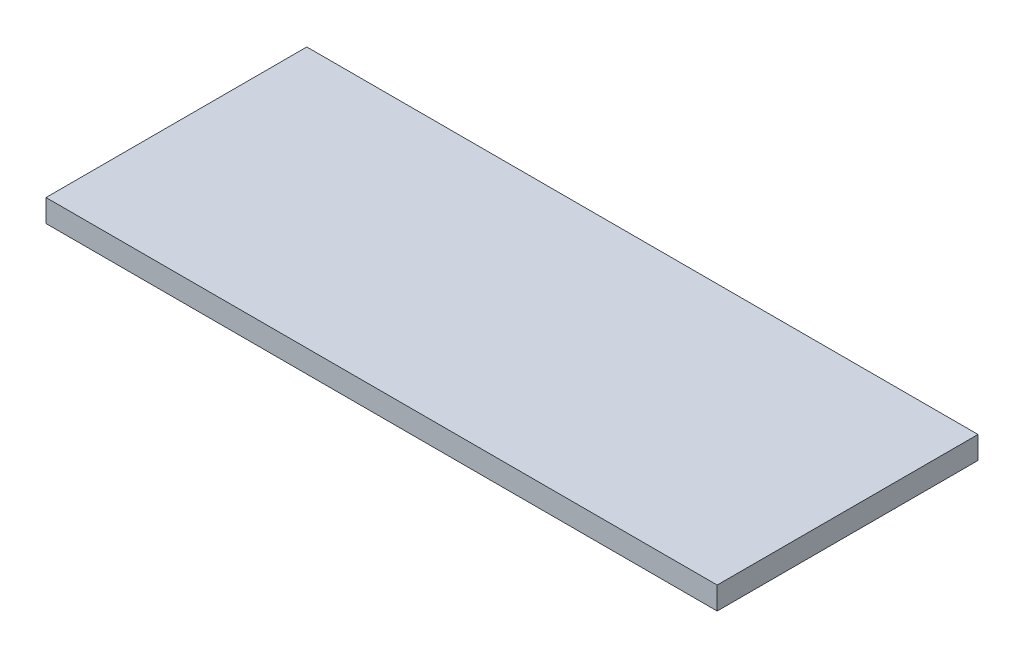
ISO-10303-21;
HEADER;
FILE_DESCRIPTION(('STEP AP214'),'2;1');
FILE_NAME('part.step','',(''),(''),'','','');
FILE_SCHEMA(('AUTOMOTIVE_DESIGN { 1 0 10303 214 1 1 1 1 }'));
ENDSEC;
DATA;
#1=APPLICATION_CONTEXT('core data for automotive mechanical design processes');
#2=APPLICATION_PROTOCOL_DEFINITION('international standard','automotive_design',2000,#1);
#3=PRODUCT_CONTEXT('',#1,'mechanical');
#4=PRODUCT('Part','Part','',(#3));
#5=PRODUCT_RELATED_PRODUCT_CATEGORY('part','',(#4));
#6=PRODUCT_DEFINITION_FORMATION('','',#4);
#7=PRODUCT_DEFINITION_CONTEXT('part definition',#1,'design');
#8=PRODUCT_DEFINITION('design','',#6,#7);
#9=PRODUCT_DEFINITION_SHAPE('','',#8);
#10=(LENGTH_UNIT() NAMED_UNIT(*) SI_UNIT(.MILLI.,.METRE.));
#11=(NAMED_UNIT(*) PLANE_ANGLE_UNIT() SI_UNIT($,.RADIAN.));
#12=(NAMED_UNIT(*) SI_UNIT($,.STERADIAN.) SOLID_ANGLE_UNIT());
#13=UNCERTAINTY_MEASURE_WITH_UNIT(LENGTH_MEASURE(1.E-05),#10,'distance_accuracy_value','');
#14=(GEOMETRIC_REPRESENTATION_CONTEXT(3) GLOBAL_UNCERTAINTY_ASSIGNED_CONTEXT((#13)) GLOBAL_UNIT_ASSIGNED_CONTEXT((#10,
#11,#12)) REPRESENTATION_CONTEXT('',''));
#15=CARTESIAN_POINT('',(0.,0.,0.));
#16=DIRECTION('',(0.,0.,1.));
#17=DIRECTION('',(1.,0.,0.));
#18=AXIS2_PLACEMENT_3D('',#15,#16,#17);
#19=CARTESIAN_POINT('',(44.65,3.,-17.35));
#20=DIRECTION('',(-1.,0.,0.));
#21=DIRECTION('',(0.,0.,1.));
#22=AXIS2_PLACEMENT_3D('',#19,#20,#21);
#23=PLANE('',#22);
#24=DIRECTION('',(0.,0.,-1.));
#25=VECTOR('',#24,1.);
#26=CARTESIAN_POINT('',(44.65,0.,-17.35));
#27=LINE('',#26,#25);
#28=CARTESIAN_POINT('',(44.65,0.,17.35));
#29=VERTEX_POINT('',#28);
#30=CARTESIAN_POINT('',(44.65,0.,-17.35));
#31=VERTEX_POINT('',#30);
#32=EDGE_CURVE('E98',#29,#31,#27,.T.);
#33=ORIENTED_EDGE('',*,*,#32,.T.);
#34=DIRECTION('',(0.,-1.,0.));
#35=VECTOR('',#34,1.);
#36=CARTESIAN_POINT('',(44.65,3.,-17.35));
#37=LINE('',#36,#35);
#38=CARTESIAN_POINT('',(44.65,3.,-17.35));
#39=VERTEX_POINT('',#38);
#40=EDGE_CURVE('E11',#39,#31,#37,.T.);
#41=ORIENTED_EDGE('',*,*,#40,.F.);
#42=DIRECTION('',(0.,0.,-1.));
#43=VECTOR('',#42,1.);
#44=CARTESIAN_POINT('',(44.65,3.,-17.35));
#45=LINE('',#44,#43);
#46=CARTESIAN_POINT('',(44.65,3.,17.35));
#47=VERTEX_POINT('',#46);
#48=EDGE_CURVE('E86',#47,#39,#45,.T.);
#49=ORIENTED_EDGE('',*,*,#48,.F.);
#50=DIRECTION('',(0.,-1.,0.));
#51=VECTOR('',#50,1.);
#52=CARTESIAN_POINT('',(44.65,3.,17.35));
#53=LINE('',#52,#51);
#54=EDGE_CURVE('E94',#47,#29,#53,.T.);
#55=ORIENTED_EDGE('',*,*,#54,.T.);
#56=EDGE_LOOP('',(#33,#41,#49,#55));
#57=FACE_BOUND('',#56,.T.);
#58=ADVANCED_FACE('F35',(#57),#23,.F.);
#59=CARTESIAN_POINT('',(-44.65,3.,-17.35));
#60=DIRECTION('',(0.,0.,1.));
#61=DIRECTION('',(1.,0.,0.));
#62=AXIS2_PLACEMENT_3D('',#59,#60,#61);
#63=PLANE('',#62);
#64=DIRECTION('',(-1.,0.,0.));
#65=VECTOR('',#64,1.);
#66=CARTESIAN_POINT('',(-44.65,0.,-17.35));
#67=LINE('',#66,#65);
#68=CARTESIAN_POINT('',(-44.65,0.,-17.35));
#69=VERTEX_POINT('',#68);
#70=EDGE_CURVE('E90',#31,#69,#67,.T.);
#71=ORIENTED_EDGE('',*,*,#70,.T.);
#72=DIRECTION('',(0.,-1.,0.));
#73=VECTOR('',#72,1.);
#74=CARTESIAN_POINT('',(-44.65,3.,-17.35));
#75=LINE('',#74,#73);
#76=CARTESIAN_POINT('',(-44.65,3.,-17.35));
#77=VERTEX_POINT('',#76);
#78=EDGE_CURVE('E43',#77,#69,#75,.T.);
#79=ORIENTED_EDGE('',*,*,#78,.F.);
#80=DIRECTION('',(-1.,0.,0.));
#81=VECTOR('',#80,1.);
#82=CARTESIAN_POINT('',(-44.65,3.,-17.35));
#83=LINE('',#82,#81);
#84=EDGE_CURVE('E81',#39,#77,#83,.T.);
#85=ORIENTED_EDGE('',*,*,#84,.F.);
#86=ORIENTED_EDGE('',*,*,#40,.T.);
#87=EDGE_LOOP('',(#71,#79,#85,#86));
#88=FACE_BOUND('',#87,.T.);
#89=ADVANCED_FACE('F89',(#88),#63,.F.);
#90=CARTESIAN_POINT('',(-44.65,3.,-17.35));
#91=DIRECTION('',(1.,0.,0.));
#92=DIRECTION('',(0.,0.,-1.));
#93=AXIS2_PLACEMENT_3D('',#90,#91,#92);
#94=PLANE('',#93);
#95=DIRECTION('',(0.,0.,1.));
#96=VECTOR('',#95,1.);
#97=CARTESIAN_POINT('',(-44.65,0.,-17.35));
#98=LINE('',#97,#96);
#99=CARTESIAN_POINT('',(-44.65,0.,17.35));
#100=VERTEX_POINT('',#99);
#101=EDGE_CURVE('E68',#69,#100,#98,.T.);
#102=ORIENTED_EDGE('',*,*,#101,.T.);
#103=DIRECTION('',(0.,-1.,0.));
#104=VECTOR('',#103,1.);
#105=CARTESIAN_POINT('',(-44.65,3.,17.35));
#106=LINE('',#105,#104);
#107=CARTESIAN_POINT('',(-44.65,3.,17.35));
#108=VERTEX_POINT('',#107);
#109=EDGE_CURVE('E91',#108,#100,#106,.T.);
#110=ORIENTED_EDGE('',*,*,#109,.F.);
#111=DIRECTION('',(0.,0.,1.));
#112=VECTOR('',#111,1.);
#113=CARTESIAN_POINT('',(-44.65,3.,-17.35));
#114=LINE('',#113,#112);
#115=EDGE_CURVE('E84',#77,#108,#114,.T.);
#116=ORIENTED_EDGE('',*,*,#115,.F.);
#117=ORIENTED_EDGE('',*,*,#78,.T.);
#118=EDGE_LOOP('',(#102,#110,#116,#117));
#119=FACE_BOUND('',#118,.T.);
#120=ADVANCED_FACE('F92',(#119),#94,.F.);
#121=CARTESIAN_POINT('',(-44.65,3.,17.35));
#122=DIRECTION('',(0.,0.,-1.));
#123=DIRECTION('',(-1.,0.,0.));
#124=AXIS2_PLACEMENT_3D('',#121,#122,#123);
#125=PLANE('',#124);
#126=DIRECTION('',(1.,0.,0.));
#127=VECTOR('',#126,1.);
#128=CARTESIAN_POINT('',(-44.65,0.,17.35));
#129=LINE('',#128,#127);
#130=EDGE_CURVE('E74',#100,#29,#129,.T.);
#131=ORIENTED_EDGE('',*,*,#130,.T.);
#132=ORIENTED_EDGE('',*,*,#54,.F.);
#133=DIRECTION('',(1.,0.,0.));
#134=VECTOR('',#133,1.);
#135=CARTESIAN_POINT('',(-44.65,3.,17.35));
#136=LINE('',#135,#134);
#137=EDGE_CURVE('E51',#108,#47,#136,.T.);
#138=ORIENTED_EDGE('',*,*,#137,.F.);
#139=ORIENTED_EDGE('',*,*,#109,.T.);
#140=EDGE_LOOP('',(#131,#132,#138,#139));
#141=FACE_BOUND('',#140,.T.);
#142=ADVANCED_FACE('F105',(#141),#125,.F.);
#143=CARTESIAN_POINT('',(0.,3.,0.));
#144=DIRECTION('',(0.,1.,0.));
#145=DIRECTION('',(0.,0.,1.));
#146=AXIS2_PLACEMENT_3D('',#143,#144,#145);
#147=PLANE('',#146);
#148=ORIENTED_EDGE('',*,*,#48,.T.);
#149=ORIENTED_EDGE('',*,*,#84,.T.);
#150=ORIENTED_EDGE('',*,*,#115,.T.);
#151=ORIENTED_EDGE('',*,*,#137,.T.);
#152=EDGE_LOOP('',(#148,#149,#150,#151));
#153=FACE_BOUND('',#152,.T.);
#154=ADVANCED_FACE('F82',(#153),#147,.T.);
#155=CARTESIAN_POINT('',(0.,0.,0.));
#156=DIRECTION('',(0.,1.,0.));
#157=DIRECTION('',(0.,0.,1.));
#158=AXIS2_PLACEMENT_3D('',#155,#156,#157);
#159=PLANE('',#158);
#160=ORIENTED_EDGE('',*,*,#32,.F.);
#161=ORIENTED_EDGE('',*,*,#130,.F.);
#162=ORIENTED_EDGE('',*,*,#101,.F.);
#163=ORIENTED_EDGE('',*,*,#70,.F.);
#164=EDGE_LOOP('',(#160,#161,#162,#163));
#165=FACE_BOUND('',#164,.T.);
#166=ADVANCED_FACE('F108',(#165),#159,.F.);
#167=CLOSED_SHELL('',(#58,#89,#120,#142,#154,#166));
#168=MANIFOLD_SOLID_BREP('B2',#167);
#169=ADVANCED_BREP_SHAPE_REPRESENTATION('',(#18,#168),#14);
#170=SHAPE_DEFINITION_REPRESENTATION(#9,#169);
ENDSEC;
END-ISO-10303-21;
